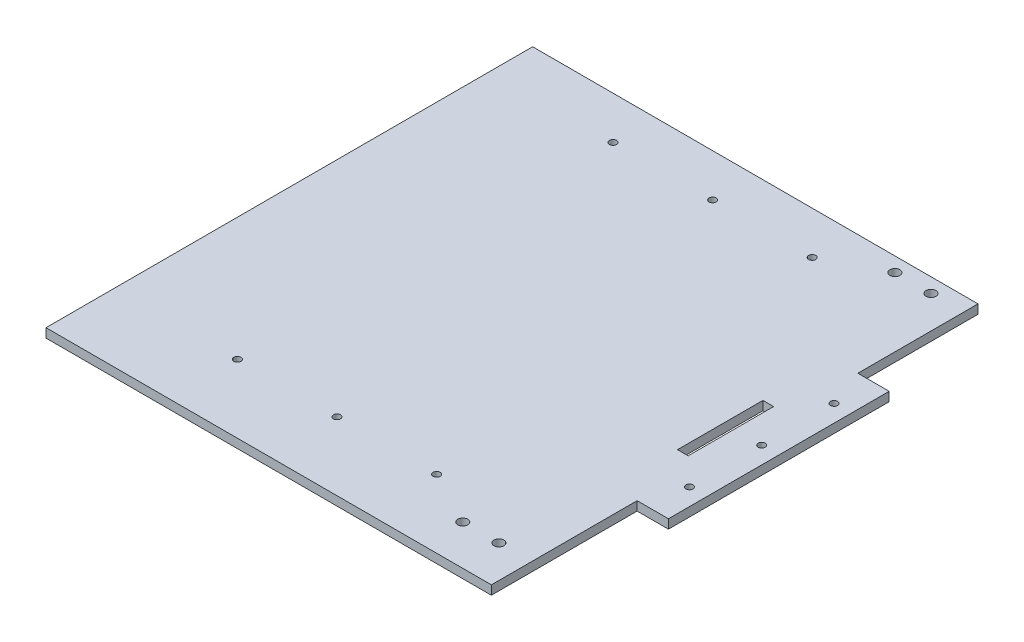
ISO-10303-21;
HEADER;
FILE_DESCRIPTION(('STEP AP214'),'2;1');
FILE_NAME('part.step','',(''),(''),'','','');
FILE_SCHEMA(('AUTOMOTIVE_DESIGN { 1 0 10303 214 1 1 1 1 }'));
ENDSEC;
DATA;
#1=APPLICATION_CONTEXT('core data for automotive mechanical design processes');
#2=APPLICATION_PROTOCOL_DEFINITION('international standard','automotive_design',2000,#1);
#3=PRODUCT_CONTEXT('',#1,'mechanical');
#4=PRODUCT('Part','Part','',(#3));
#5=PRODUCT_RELATED_PRODUCT_CATEGORY('part','',(#4));
#6=PRODUCT_DEFINITION_FORMATION('','',#4);
#7=PRODUCT_DEFINITION_CONTEXT('part definition',#1,'design');
#8=PRODUCT_DEFINITION('design','',#6,#7);
#9=PRODUCT_DEFINITION_SHAPE('','',#8);
#10=(LENGTH_UNIT() NAMED_UNIT(*) SI_UNIT(.MILLI.,.METRE.));
#11=(NAMED_UNIT(*) PLANE_ANGLE_UNIT() SI_UNIT($,.RADIAN.));
#12=(NAMED_UNIT(*) SI_UNIT($,.STERADIAN.) SOLID_ANGLE_UNIT());
#13=UNCERTAINTY_MEASURE_WITH_UNIT(LENGTH_MEASURE(1.E-05),#10,'distance_accuracy_value','');
#14=(GEOMETRIC_REPRESENTATION_CONTEXT(3) GLOBAL_UNCERTAINTY_ASSIGNED_CONTEXT((#13)) GLOBAL_UNIT_ASSIGNED_CONTEXT((#10,
#11,#12)) REPRESENTATION_CONTEXT('',''));
#15=CARTESIAN_POINT('',(0.,0.,0.));
#16=DIRECTION('',(0.,0.,1.));
#17=DIRECTION('',(1.,0.,0.));
#18=AXIS2_PLACEMENT_3D('',#15,#16,#17);
#19=CARTESIAN_POINT('',(156.499999999998,-6.35,171.));
#20=DIRECTION('',(1.,0.,0.));
#21=DIRECTION('',(0.,0.,-1.));
#22=AXIS2_PLACEMENT_3D('',#19,#20,#21);
#23=PLANE('',#22);
#24=DIRECTION('',(0.,0.,-1.));
#25=VECTOR('',#24,1.);
#26=CARTESIAN_POINT('',(156.499999999998,-6.35,171.));
#27=LINE('',#26,#25);
#28=CARTESIAN_POINT('',(156.499999999998,-6.35,171.));
#29=VERTEX_POINT('',#28);
#30=CARTESIAN_POINT('',(156.499999999998,-6.35,68.570201764885));
#31=VERTEX_POINT('',#30);
#32=EDGE_CURVE('E268',#29,#31,#27,.T.);
#33=ORIENTED_EDGE('',*,*,#32,.T.);
#34=DIRECTION('',(0.,1.,0.));
#35=VECTOR('',#34,1.);
#36=CARTESIAN_POINT('',(156.499999999998,-6.35,68.570201764885));
#37=LINE('',#36,#35);
#38=CARTESIAN_POINT('',(156.499999999998,0.,68.570201764885));
#39=VERTEX_POINT('',#38);
#40=EDGE_CURVE('E259',#31,#39,#37,.T.);
#41=ORIENTED_EDGE('',*,*,#40,.T.);
#42=DIRECTION('',(0.,0.,-1.));
#43=VECTOR('',#42,1.);
#44=CARTESIAN_POINT('',(156.499999999998,0.,171.));
#45=LINE('',#44,#43);
#46=CARTESIAN_POINT('',(156.499999999998,0.,171.));
#47=VERTEX_POINT('',#46);
#48=EDGE_CURVE('E281',#47,#39,#45,.T.);
#49=ORIENTED_EDGE('',*,*,#48,.F.);
#50=DIRECTION('',(0.,1.,0.));
#51=VECTOR('',#50,1.);
#52=CARTESIAN_POINT('',(156.499999999998,-6.35,171.));
#53=LINE('',#52,#51);
#54=EDGE_CURVE('E11',#29,#47,#53,.T.);
#55=ORIENTED_EDGE('',*,*,#54,.F.);
#56=EDGE_LOOP('',(#33,#41,#49,#55));
#57=FACE_BOUND('',#56,.T.);
#58=ADVANCED_FACE('F37',(#57),#23,.T.);
#59=DIRECTION('',(0.,1.,0.));
#60=VECTOR('',#59,1.);
#61=CARTESIAN_POINT('',(156.499999999998,-6.35,-86.570201764878));
#62=LINE('',#61,#60);
#63=CARTESIAN_POINT('',(156.499999999998,-6.35,-86.570201764878));
#64=VERTEX_POINT('',#63);
#65=CARTESIAN_POINT('',(156.499999999998,0.,-86.570201764878));
#66=VERTEX_POINT('',#65);
#67=EDGE_CURVE('E263',#64,#66,#62,.T.);
#68=ORIENTED_EDGE('',*,*,#67,.F.);
#69=CARTESIAN_POINT('',(156.499999999998,-6.35,-171.));
#70=VERTEX_POINT('',#69);
#71=EDGE_CURVE('E272',#64,#70,#27,.T.);
#72=ORIENTED_EDGE('',*,*,#71,.T.);
#73=DIRECTION('',(0.,1.,0.));
#74=VECTOR('',#73,1.);
#75=CARTESIAN_POINT('',(156.499999999998,-6.35,-171.));
#76=LINE('',#75,#74);
#77=CARTESIAN_POINT('',(156.499999999998,0.,-171.));
#78=VERTEX_POINT('',#77);
#79=EDGE_CURVE('E41',#70,#78,#76,.T.);
#80=ORIENTED_EDGE('',*,*,#79,.T.);
#81=EDGE_CURVE('E262',#66,#78,#45,.T.);
#82=ORIENTED_EDGE('',*,*,#81,.F.);
#83=EDGE_LOOP('',(#68,#72,#80,#82));
#84=FACE_BOUND('',#83,.T.);
#85=ADVANCED_FACE('F39',(#84),#23,.T.);
#86=CARTESIAN_POINT('',(-156.500000000002,-6.35,171.));
#87=DIRECTION('',(0.,0.,1.));
#88=DIRECTION('',(1.,0.,0.));
#89=AXIS2_PLACEMENT_3D('',#86,#87,#88);
#90=PLANE('',#89);
#91=DIRECTION('',(1.,0.,0.));
#92=VECTOR('',#91,1.);
#93=CARTESIAN_POINT('',(-156.500000000002,0.,171.));
#94=LINE('',#93,#92);
#95=CARTESIAN_POINT('',(-156.500000000002,0.,171.));
#96=VERTEX_POINT('',#95);
#97=EDGE_CURVE('E290',#96,#47,#94,.T.);
#98=ORIENTED_EDGE('',*,*,#97,.F.);
#99=DIRECTION('',(0.,1.,0.));
#100=VECTOR('',#99,1.);
#101=CARTESIAN_POINT('',(-156.500000000002,-6.35,171.));
#102=LINE('',#101,#100);
#103=CARTESIAN_POINT('',(-156.500000000002,-6.35,171.));
#104=VERTEX_POINT('',#103);
#105=EDGE_CURVE('E46',#104,#96,#102,.T.);
#106=ORIENTED_EDGE('',*,*,#105,.F.);
#107=DIRECTION('',(1.,0.,0.));
#108=VECTOR('',#107,1.);
#109=CARTESIAN_POINT('',(-156.500000000002,-6.35,171.));
#110=LINE('',#109,#108);
#111=EDGE_CURVE('E278',#104,#29,#110,.T.);
#112=ORIENTED_EDGE('',*,*,#111,.T.);
#113=ORIENTED_EDGE('',*,*,#54,.T.);
#114=EDGE_LOOP('',(#98,#106,#112,#113));
#115=FACE_BOUND('',#114,.T.);
#116=ADVANCED_FACE('F323',(#115),#90,.T.);
#117=CARTESIAN_POINT('',(-156.500000000002,-6.35,171.));
#118=DIRECTION('',(-1.,0.,0.));
#119=DIRECTION('',(0.,0.,1.));
#120=AXIS2_PLACEMENT_3D('',#117,#118,#119);
#121=PLANE('',#120);
#122=DIRECTION('',(0.,0.,1.));
#123=VECTOR('',#122,1.);
#124=CARTESIAN_POINT('',(-156.500000000002,0.,171.));
#125=LINE('',#124,#123);
#126=CARTESIAN_POINT('',(-156.500000000002,0.,-171.));
#127=VERTEX_POINT('',#126);
#128=EDGE_CURVE('E287',#127,#96,#125,.T.);
#129=ORIENTED_EDGE('',*,*,#128,.F.);
#130=DIRECTION('',(0.,1.,0.));
#131=VECTOR('',#130,1.);
#132=CARTESIAN_POINT('',(-156.500000000002,-6.35,-171.));
#133=LINE('',#132,#131);
#134=CARTESIAN_POINT('',(-156.500000000002,-6.35,-171.));
#135=VERTEX_POINT('',#134);
#136=EDGE_CURVE('E293',#135,#127,#133,.T.);
#137=ORIENTED_EDGE('',*,*,#136,.F.);
#138=DIRECTION('',(0.,0.,1.));
#139=VECTOR('',#138,1.);
#140=CARTESIAN_POINT('',(-156.500000000002,-6.35,171.));
#141=LINE('',#140,#139);
#142=EDGE_CURVE('E275',#135,#104,#141,.T.);
#143=ORIENTED_EDGE('',*,*,#142,.T.);
#144=ORIENTED_EDGE('',*,*,#105,.T.);
#145=EDGE_LOOP('',(#129,#137,#143,#144));
#146=FACE_BOUND('',#145,.T.);
#147=ADVANCED_FACE('F321',(#146),#121,.T.);
#148=CARTESIAN_POINT('',(-156.500000000002,-6.35,-171.));
#149=DIRECTION('',(0.,0.,-1.));
#150=DIRECTION('',(-1.,0.,0.));
#151=AXIS2_PLACEMENT_3D('',#148,#149,#150);
#152=PLANE('',#151);
#153=DIRECTION('',(-1.,0.,0.));
#154=VECTOR('',#153,1.);
#155=CARTESIAN_POINT('',(-156.500000000002,0.,-171.));
#156=LINE('',#155,#154);
#157=EDGE_CURVE('E284',#78,#127,#156,.T.);
#158=ORIENTED_EDGE('',*,*,#157,.F.);
#159=ORIENTED_EDGE('',*,*,#79,.F.);
#160=DIRECTION('',(-1.,0.,0.));
#161=VECTOR('',#160,1.);
#162=CARTESIAN_POINT('',(-156.500000000002,-6.35,-171.));
#163=LINE('',#162,#161);
#164=EDGE_CURVE('E271',#70,#135,#163,.T.);
#165=ORIENTED_EDGE('',*,*,#164,.T.);
#166=ORIENTED_EDGE('',*,*,#136,.T.);
#167=EDGE_LOOP('',(#158,#159,#165,#166));
#168=FACE_BOUND('',#167,.T.);
#169=ADVANCED_FACE('F304',(#168),#152,.T.);
#170=CARTESIAN_POINT('',(0.,-6.35,0.));
#171=DIRECTION('',(0.,-1.,0.));
#172=DIRECTION('',(0.,0.,-1.));
#173=AXIS2_PLACEMENT_3D('',#170,#171,#172);
#174=PLANE('',#173);
#175=DIRECTION('',(-0.000470825318969859,0.,0.999999889161753));
#176=VECTOR('',#175,1.);
#177=CARTESIAN_POINT('',(139.643523721175,-6.35000000001192,23.3262165093637));
#178=LINE('',#177,#176);
#179=CARTESIAN_POINT('',(139.671773243444,-6.35000000001192,-36.6737834906363));
#180=VERTEX_POINT('',#179);
#181=CARTESIAN_POINT('',(139.643523721175,-6.35000000001192,23.3262165093637));
#182=VERTEX_POINT('',#181);
#183=EDGE_CURVE('E129',#180,#182,#178,.T.);
#184=ORIENTED_EDGE('',*,*,#183,.T.);
#185=DIRECTION('',(1.,0.,0.));
#186=VECTOR('',#185,1.);
#187=CARTESIAN_POINT('',(147.143523721174,-6.35000000001192,23.3262165093637));
#188=LINE('',#187,#186);
#189=CARTESIAN_POINT('',(147.143523721174,-6.35,23.3262165093637));
#190=VERTEX_POINT('',#189);
#191=EDGE_CURVE('E138',#182,#190,#188,.T.);
#192=ORIENTED_EDGE('',*,*,#191,.T.);
#193=DIRECTION('',(0.00047082531897171,0.,-0.999999889161753));
#194=VECTOR('',#193,1.);
#195=CARTESIAN_POINT('',(147.171773243444,-6.35000000001192,-36.6737834906363));
#196=LINE('',#195,#194);
#197=CARTESIAN_POINT('',(147.171773243444,-6.35000000001192,-36.6737834906363));
#198=VERTEX_POINT('',#197);
#199=EDGE_CURVE('E54',#190,#198,#196,.T.);
#200=ORIENTED_EDGE('',*,*,#199,.T.);
#201=DIRECTION('',(-1.,0.,0.));
#202=VECTOR('',#201,1.);
#203=CARTESIAN_POINT('',(139.671773243444,-6.35000000001192,-36.6737834906363));
#204=LINE('',#203,#202);
#205=EDGE_CURVE('E135',#198,#180,#204,.T.);
#206=ORIENTED_EDGE('',*,*,#205,.T.);
#207=EDGE_LOOP('',(#184,#192,#200,#206));
#208=FACE_BOUND('',#207,.T.);
#209=CARTESIAN_POINT('',(133.639999999997,-6.35000000001205,142.840000000007));
#210=DIRECTION('',(0.,-1.,0.));
#211=DIRECTION('',(0.,0.,-1.));
#212=AXIS2_PLACEMENT_3D('',#209,#210,#211);
#213=CIRCLE('',#212,3.49999999999999);
#214=CARTESIAN_POINT('',(133.639999999997,-6.35000000001192,139.340000000007));
#215=VERTEX_POINT('',#214);
#216=EDGE_CURVE('E164',#215,#215,#213,.T.);
#217=ORIENTED_EDGE('',*,*,#216,.F.);
#218=EDGE_LOOP('',(#217));
#219=FACE_BOUND('',#218,.T.);
#220=CARTESIAN_POINT('',(108.239999999997,-6.35000000001205,142.840000000007));
#221=DIRECTION('',(0.,-1.,0.));
#222=DIRECTION('',(0.,0.,-1.));
#223=AXIS2_PLACEMENT_3D('',#220,#221,#222);
#224=CIRCLE('',#223,3.50000000000001);
#225=CARTESIAN_POINT('',(108.239999999997,-6.35000000001192,139.340000000007));
#226=VERTEX_POINT('',#225);
#227=EDGE_CURVE('E171',#226,#226,#224,.T.);
#228=ORIENTED_EDGE('',*,*,#227,.F.);
#229=EDGE_LOOP('',(#228));
#230=FACE_BOUND('',#229,.T.);
#231=CARTESIAN_POINT('',(133.639999999998,-6.35,-160.84));
#232=DIRECTION('',(0.,1.,0.));
#233=DIRECTION('',(0.,0.,1.));
#234=AXIS2_PLACEMENT_3D('',#231,#232,#233);
#235=CIRCLE('',#234,3.49999999999999);
#236=CARTESIAN_POINT('',(133.639999999998,-6.35,-157.34));
#237=VERTEX_POINT('',#236);
#238=EDGE_CURVE('E176',#237,#237,#235,.T.);
#239=ORIENTED_EDGE('',*,*,#238,.T.);
#240=EDGE_LOOP('',(#239));
#241=FACE_BOUND('',#240,.T.);
#242=CARTESIAN_POINT('',(108.239999999998,-6.35,-160.84));
#243=DIRECTION('',(0.,1.,0.));
#244=DIRECTION('',(0.,0.,1.));
#245=AXIS2_PLACEMENT_3D('',#242,#243,#244);
#246=CIRCLE('',#245,3.50000000000001);
#247=CARTESIAN_POINT('',(108.239999999998,-6.35,-157.34));
#248=VERTEX_POINT('',#247);
#249=EDGE_CURVE('E167',#248,#248,#246,.T.);
#250=ORIENTED_EDGE('',*,*,#249,.T.);
#251=EDGE_LOOP('',(#250));
#252=FACE_BOUND('',#251,.T.);
#253=CARTESIAN_POINT('',(-70.0000000000018,-6.35,123.000000000004));
#254=DIRECTION('',(0.,1.,0.));
#255=DIRECTION('',(0.,0.,1.));
#256=AXIS2_PLACEMENT_3D('',#253,#254,#255);
#257=CIRCLE('',#256,2.5);
#258=CARTESIAN_POINT('',(-70.0000000000018,-6.35,125.500000000004));
#259=VERTEX_POINT('',#258);
#260=EDGE_CURVE('E198',#259,#259,#257,.T.);
#261=ORIENTED_EDGE('',*,*,#260,.T.);
#262=EDGE_LOOP('',(#261));
#263=FACE_BOUND('',#262,.T.);
#264=CARTESIAN_POINT('',(69.9999999999982,-6.35,123.000000000004));
#265=DIRECTION('',(0.,1.,0.));
#266=DIRECTION('',(0.,0.,-1.));
#267=AXIS2_PLACEMENT_3D('',#264,#265,#266);
#268=CIRCLE('',#267,2.5);
#269=CARTESIAN_POINT('',(69.9999999999982,-6.35,120.500000000004));
#270=VERTEX_POINT('',#269);
#271=EDGE_CURVE('E204',#270,#270,#268,.T.);
#272=ORIENTED_EDGE('',*,*,#271,.T.);
#273=EDGE_LOOP('',(#272));
#274=FACE_BOUND('',#273,.T.);
#275=CARTESIAN_POINT('',(-70.0000000000018,-6.35,-140.999999999997));
#276=DIRECTION('',(0.,1.,0.));
#277=DIRECTION('',(0.,0.,-1.));
#278=AXIS2_PLACEMENT_3D('',#275,#276,#277);
#279=CIRCLE('',#278,2.5);
#280=CARTESIAN_POINT('',(-70.0000000000018,-6.35,-143.499999999997));
#281=VERTEX_POINT('',#280);
#282=EDGE_CURVE('E210',#281,#281,#279,.T.);
#283=ORIENTED_EDGE('',*,*,#282,.T.);
#284=EDGE_LOOP('',(#283));
#285=FACE_BOUND('',#284,.T.);
#286=CARTESIAN_POINT('',(-1.77635683940025E-12,-6.35,-140.999999999996));
#287=DIRECTION('',(0.,1.,0.));
#288=DIRECTION('',(0.,0.,-1.));
#289=AXIS2_PLACEMENT_3D('',#286,#287,#288);
#290=CIRCLE('',#289,2.49999999999998);
#291=CARTESIAN_POINT('',(-1.77635683940025E-12,-6.35,-143.499999999996));
#292=VERTEX_POINT('',#291);
#293=EDGE_CURVE('E191',#292,#292,#290,.T.);
#294=ORIENTED_EDGE('',*,*,#293,.T.);
#295=EDGE_LOOP('',(#294));
#296=FACE_BOUND('',#295,.T.);
#297=CARTESIAN_POINT('',(69.9999999999982,-6.35,-140.999999999997));
#298=DIRECTION('',(0.,1.,0.));
#299=DIRECTION('',(0.,0.,1.));
#300=AXIS2_PLACEMENT_3D('',#297,#298,#299);
#301=CIRCLE('',#300,2.5);
#302=CARTESIAN_POINT('',(69.9999999999982,-6.35,-138.499999999997));
#303=VERTEX_POINT('',#302);
#304=EDGE_CURVE('E179',#303,#303,#301,.T.);
#305=ORIENTED_EDGE('',*,*,#304,.T.);
#306=EDGE_LOOP('',(#305));
#307=FACE_BOUND('',#306,.T.);
#308=CARTESIAN_POINT('',(-1.77635683940025E-12,-6.35,123.000000000004));
#309=DIRECTION('',(0.,1.,0.));
#310=DIRECTION('',(0.,0.,1.));
#311=AXIS2_PLACEMENT_3D('',#308,#309,#310);
#312=CIRCLE('',#311,2.5);
#313=CARTESIAN_POINT('',(-1.77635683940025E-12,-6.35,125.500000000004));
#314=VERTEX_POINT('',#313);
#315=EDGE_CURVE('E218',#314,#314,#312,.T.);
#316=ORIENTED_EDGE('',*,*,#315,.T.);
#317=EDGE_LOOP('',(#316));
#318=FACE_BOUND('',#317,.T.);
#319=ORIENTED_EDGE('',*,*,#32,.F.);
#320=ORIENTED_EDGE('',*,*,#111,.F.);
#321=ORIENTED_EDGE('',*,*,#142,.F.);
#322=ORIENTED_EDGE('',*,*,#164,.F.);
#323=ORIENTED_EDGE('',*,*,#71,.F.);
#324=DIRECTION('',(-1.,0.,0.));
#325=VECTOR('',#324,1.);
#326=CARTESIAN_POINT('',(178.499999999998,-6.35,-86.570201764878));
#327=LINE('',#326,#325);
#328=CARTESIAN_POINT('',(178.499999999998,-6.35,-86.570201764878));
#329=VERTEX_POINT('',#328);
#330=EDGE_CURVE('E249',#329,#64,#327,.T.);
#331=ORIENTED_EDGE('',*,*,#330,.F.);
#332=DIRECTION('',(0.,0.,-1.));
#333=VECTOR('',#332,1.);
#334=CARTESIAN_POINT('',(178.499999999998,-6.35,68.570201764885));
#335=LINE('',#334,#333);
#336=CARTESIAN_POINT('',(178.499999999998,-6.35,68.570201764885));
#337=VERTEX_POINT('',#336);
#338=EDGE_CURVE('E245',#337,#329,#335,.T.);
#339=ORIENTED_EDGE('',*,*,#338,.F.);
#340=DIRECTION('',(1.,0.,0.));
#341=VECTOR('',#340,1.);
#342=CARTESIAN_POINT('',(156.499999999998,-6.35,68.570201764885));
#343=LINE('',#342,#341);
#344=EDGE_CURVE('E242',#31,#337,#343,.T.);
#345=ORIENTED_EDGE('',*,*,#344,.F.);
#346=EDGE_LOOP('',(#319,#320,#321,#322,#323,#331,#339,#345));
#347=FACE_BOUND('',#346,.T.);
#348=CARTESIAN_POINT('',(166.499999999998,-6.35,-59.7999999999965));
#349=DIRECTION('',(0.,1.,0.));
#350=DIRECTION('',(0.,0.,-1.));
#351=AXIS2_PLACEMENT_3D('',#348,#349,#350);
#352=CIRCLE('',#351,2.5);
#353=CARTESIAN_POINT('',(166.499999999998,-6.35,-62.2999999999965));
#354=VERTEX_POINT('',#353);
#355=EDGE_CURVE('E224',#354,#354,#352,.T.);
#356=ORIENTED_EDGE('',*,*,#355,.T.);
#357=EDGE_LOOP('',(#356));
#358=FACE_BOUND('',#357,.T.);
#359=CARTESIAN_POINT('',(166.499999999998,-6.35,41.8000000000035));
#360=DIRECTION('',(0.,1.,0.));
#361=DIRECTION('',(0.,0.,1.));
#362=AXIS2_PLACEMENT_3D('',#359,#360,#361);
#363=CIRCLE('',#362,2.5);
#364=CARTESIAN_POINT('',(166.499999999998,-6.35,44.3000000000035));
#365=VERTEX_POINT('',#364);
#366=EDGE_CURVE('E230',#365,#365,#363,.T.);
#367=ORIENTED_EDGE('',*,*,#366,.T.);
#368=EDGE_LOOP('',(#367));
#369=FACE_BOUND('',#368,.T.);
#370=CARTESIAN_POINT('',(166.499999999998,-6.35,-8.99999999999648));
#371=DIRECTION('',(0.,1.,0.));
#372=DIRECTION('',(0.,0.,1.));
#373=AXIS2_PLACEMENT_3D('',#370,#371,#372);
#374=CIRCLE('',#373,2.5);
#375=CARTESIAN_POINT('',(166.499999999998,-6.35,-6.49999999999649));
#376=VERTEX_POINT('',#375);
#377=EDGE_CURVE('E236',#376,#376,#374,.T.);
#378=ORIENTED_EDGE('',*,*,#377,.T.);
#379=EDGE_LOOP('',(#378));
#380=FACE_BOUND('',#379,.T.);
#381=ADVANCED_FACE('F142',(#208,#219,#230,#241,#252,#263,#274,#285,#296,#307,#318,#347,#358,
#369,#380),#174,.T.);
#382=CARTESIAN_POINT('',(0.,0.,0.));
#383=DIRECTION('',(0.,-1.,0.));
#384=DIRECTION('',(0.,0.,-1.));
#385=AXIS2_PLACEMENT_3D('',#382,#383,#384);
#386=PLANE('',#385);
#387=DIRECTION('',(1.,0.,0.));
#388=VECTOR('',#387,1.);
#389=CARTESIAN_POINT('',(147.143523721174,0.,23.3262165093637));
#390=LINE('',#389,#388);
#391=CARTESIAN_POINT('',(139.643523721175,0.,23.3262165093637));
#392=VERTEX_POINT('',#391);
#393=CARTESIAN_POINT('',(147.143523721174,0.,23.3262165093637));
#394=VERTEX_POINT('',#393);
#395=EDGE_CURVE('E154',#392,#394,#390,.T.);
#396=ORIENTED_EDGE('',*,*,#395,.F.);
#397=DIRECTION('',(-0.000470825318969859,0.,0.999999889161753));
#398=VECTOR('',#397,1.);
#399=CARTESIAN_POINT('',(139.643523721175,0.,23.3262165093637));
#400=LINE('',#399,#398);
#401=CARTESIAN_POINT('',(139.671773243444,0.,-36.6737834906363));
#402=VERTEX_POINT('',#401);
#403=EDGE_CURVE('E62',#402,#392,#400,.T.);
#404=ORIENTED_EDGE('',*,*,#403,.F.);
#405=DIRECTION('',(-1.,0.,0.));
#406=VECTOR('',#405,1.);
#407=CARTESIAN_POINT('',(139.671773243444,0.,-36.6737834906363));
#408=LINE('',#407,#406);
#409=CARTESIAN_POINT('',(147.171773243444,0.,-36.6737834906363));
#410=VERTEX_POINT('',#409);
#411=EDGE_CURVE('E145',#410,#402,#408,.T.);
#412=ORIENTED_EDGE('',*,*,#411,.F.);
#413=DIRECTION('',(0.00047082531897171,0.,-0.999999889161753));
#414=VECTOR('',#413,1.);
#415=CARTESIAN_POINT('',(147.171773243444,0.,-36.6737834906363));
#416=LINE('',#415,#414);
#417=EDGE_CURVE('E148',#394,#410,#416,.T.);
#418=ORIENTED_EDGE('',*,*,#417,.F.);
#419=EDGE_LOOP('',(#396,#404,#412,#418));
#420=FACE_BOUND('',#419,.T.);
#421=CARTESIAN_POINT('',(133.639999999997,-5.83162409271469E-12,142.840000000007));
#422=DIRECTION('',(0.,-1.,0.));
#423=DIRECTION('',(0.,0.,-1.));
#424=AXIS2_PLACEMENT_3D('',#421,#422,#423);
#425=CIRCLE('',#424,3.49999999999999);
#426=CARTESIAN_POINT('',(133.639999999997,-5.69720177761655E-12,139.340000000007));
#427=VERTEX_POINT('',#426);
#428=EDGE_CURVE('E168',#427,#427,#425,.T.);
#429=ORIENTED_EDGE('',*,*,#428,.T.);
#430=EDGE_LOOP('',(#429));
#431=FACE_BOUND('',#430,.T.);
#432=CARTESIAN_POINT('',(108.239999999997,-5.83162409271469E-12,142.840000000007));
#433=DIRECTION('',(0.,-1.,0.));
#434=DIRECTION('',(0.,0.,-1.));
#435=AXIS2_PLACEMENT_3D('',#432,#433,#434);
#436=CIRCLE('',#435,3.50000000000001);
#437=CARTESIAN_POINT('',(108.239999999997,-5.69720177761655E-12,139.340000000007));
#438=VERTEX_POINT('',#437);
#439=EDGE_CURVE('E160',#438,#438,#436,.T.);
#440=ORIENTED_EDGE('',*,*,#439,.T.);
#441=EDGE_LOOP('',(#440));
#442=FACE_BOUND('',#441,.T.);
#443=CARTESIAN_POINT('',(133.639999999998,0.,-160.84));
#444=DIRECTION('',(0.,1.,0.));
#445=DIRECTION('',(0.,0.,1.));
#446=AXIS2_PLACEMENT_3D('',#443,#444,#445);
#447=CIRCLE('',#446,3.49999999999999);
#448=CARTESIAN_POINT('',(133.639999999998,0.,-157.34));
#449=VERTEX_POINT('',#448);
#450=EDGE_CURVE('E180',#449,#449,#447,.T.);
#451=ORIENTED_EDGE('',*,*,#450,.F.);
#452=EDGE_LOOP('',(#451));
#453=FACE_BOUND('',#452,.T.);
#454=CARTESIAN_POINT('',(108.239999999998,0.,-160.84));
#455=DIRECTION('',(0.,1.,0.));
#456=DIRECTION('',(0.,0.,1.));
#457=AXIS2_PLACEMENT_3D('',#454,#455,#456);
#458=CIRCLE('',#457,3.50000000000001);
#459=CARTESIAN_POINT('',(108.239999999998,0.,-157.34));
#460=VERTEX_POINT('',#459);
#461=EDGE_CURVE('E183',#460,#460,#458,.T.);
#462=ORIENTED_EDGE('',*,*,#461,.F.);
#463=EDGE_LOOP('',(#462));
#464=FACE_BOUND('',#463,.T.);
#465=CARTESIAN_POINT('',(-70.0000000000018,0.,123.000000000004));
#466=DIRECTION('',(0.,1.,0.));
#467=DIRECTION('',(0.,0.,1.));
#468=AXIS2_PLACEMENT_3D('',#465,#466,#467);
#469=CIRCLE('',#468,2.5);
#470=CARTESIAN_POINT('',(-70.0000000000018,0.,125.500000000004));
#471=VERTEX_POINT('',#470);
#472=EDGE_CURVE('E194',#471,#471,#469,.T.);
#473=ORIENTED_EDGE('',*,*,#472,.F.);
#474=EDGE_LOOP('',(#473));
#475=FACE_BOUND('',#474,.T.);
#476=CARTESIAN_POINT('',(69.9999999999982,0.,123.000000000004));
#477=DIRECTION('',(0.,1.,0.));
#478=DIRECTION('',(0.,0.,-1.));
#479=AXIS2_PLACEMENT_3D('',#476,#477,#478);
#480=CIRCLE('',#479,2.5);
#481=CARTESIAN_POINT('',(69.9999999999982,0.,120.500000000004));
#482=VERTEX_POINT('',#481);
#483=EDGE_CURVE('E201',#482,#482,#480,.T.);
#484=ORIENTED_EDGE('',*,*,#483,.F.);
#485=EDGE_LOOP('',(#484));
#486=FACE_BOUND('',#485,.T.);
#487=CARTESIAN_POINT('',(-70.0000000000018,0.,-140.999999999997));
#488=DIRECTION('',(0.,1.,0.));
#489=DIRECTION('',(0.,0.,-1.));
#490=AXIS2_PLACEMENT_3D('',#487,#488,#489);
#491=CIRCLE('',#490,2.5);
#492=CARTESIAN_POINT('',(-70.0000000000018,0.,-143.499999999997));
#493=VERTEX_POINT('',#492);
#494=EDGE_CURVE('E207',#493,#493,#491,.T.);
#495=ORIENTED_EDGE('',*,*,#494,.F.);
#496=EDGE_LOOP('',(#495));
#497=FACE_BOUND('',#496,.T.);
#498=CARTESIAN_POINT('',(-1.77635683940025E-12,0.,-140.999999999996));
#499=DIRECTION('',(0.,1.,0.));
#500=DIRECTION('',(0.,0.,-1.));
#501=AXIS2_PLACEMENT_3D('',#498,#499,#500);
#502=CIRCLE('',#501,2.49999999999998);
#503=CARTESIAN_POINT('',(-1.77635683940025E-12,0.,-143.499999999996));
#504=VERTEX_POINT('',#503);
#505=EDGE_CURVE('E213',#504,#504,#502,.T.);
#506=ORIENTED_EDGE('',*,*,#505,.F.);
#507=EDGE_LOOP('',(#506));
#508=FACE_BOUND('',#507,.T.);
#509=CARTESIAN_POINT('',(69.9999999999982,0.,-140.999999999997));
#510=DIRECTION('',(0.,1.,0.));
#511=DIRECTION('',(0.,0.,1.));
#512=AXIS2_PLACEMENT_3D('',#509,#510,#511);
#513=CIRCLE('',#512,2.5);
#514=CARTESIAN_POINT('',(69.9999999999982,0.,-138.499999999997));
#515=VERTEX_POINT('',#514);
#516=EDGE_CURVE('E188',#515,#515,#513,.T.);
#517=ORIENTED_EDGE('',*,*,#516,.F.);
#518=EDGE_LOOP('',(#517));
#519=FACE_BOUND('',#518,.T.);
#520=CARTESIAN_POINT('',(-1.77635683940025E-12,0.,123.000000000004));
#521=DIRECTION('',(0.,1.,0.));
#522=DIRECTION('',(0.,0.,1.));
#523=AXIS2_PLACEMENT_3D('',#520,#521,#522);
#524=CIRCLE('',#523,2.5);
#525=CARTESIAN_POINT('',(-1.77635683940025E-12,0.,125.500000000004));
#526=VERTEX_POINT('',#525);
#527=EDGE_CURVE('E197',#526,#526,#524,.T.);
#528=ORIENTED_EDGE('',*,*,#527,.F.);
#529=EDGE_LOOP('',(#528));
#530=FACE_BOUND('',#529,.T.);
#531=ORIENTED_EDGE('',*,*,#48,.T.);
#532=DIRECTION('',(1.,0.,0.));
#533=VECTOR('',#532,1.);
#534=CARTESIAN_POINT('',(156.499999999998,0.,68.570201764885));
#535=LINE('',#534,#533);
#536=CARTESIAN_POINT('',(178.499999999998,0.,68.570201764885));
#537=VERTEX_POINT('',#536);
#538=EDGE_CURVE('E239',#39,#537,#535,.T.);
#539=ORIENTED_EDGE('',*,*,#538,.T.);
#540=DIRECTION('',(0.,0.,-1.));
#541=VECTOR('',#540,1.);
#542=CARTESIAN_POINT('',(178.499999999998,0.,68.570201764885));
#543=LINE('',#542,#541);
#544=CARTESIAN_POINT('',(178.499999999998,0.,-86.570201764878));
#545=VERTEX_POINT('',#544);
#546=EDGE_CURVE('E254',#537,#545,#543,.T.);
#547=ORIENTED_EDGE('',*,*,#546,.T.);
#548=DIRECTION('',(-1.,0.,0.));
#549=VECTOR('',#548,1.);
#550=CARTESIAN_POINT('',(178.499999999998,0.,-86.570201764878));
#551=LINE('',#550,#549);
#552=EDGE_CURVE('E246',#545,#66,#551,.T.);
#553=ORIENTED_EDGE('',*,*,#552,.T.);
#554=ORIENTED_EDGE('',*,*,#81,.T.);
#555=ORIENTED_EDGE('',*,*,#157,.T.);
#556=ORIENTED_EDGE('',*,*,#128,.T.);
#557=ORIENTED_EDGE('',*,*,#97,.T.);
#558=EDGE_LOOP('',(#531,#539,#547,#553,#554,#555,#556,#557));
#559=FACE_BOUND('',#558,.T.);
#560=CARTESIAN_POINT('',(166.499999999998,0.,-59.7999999999965));
#561=DIRECTION('',(0.,1.,0.));
#562=DIRECTION('',(0.,0.,-1.));
#563=AXIS2_PLACEMENT_3D('',#560,#561,#562);
#564=CIRCLE('',#563,2.5);
#565=CARTESIAN_POINT('',(166.499999999998,0.,-62.2999999999965));
#566=VERTEX_POINT('',#565);
#567=EDGE_CURVE('E221',#566,#566,#564,.T.);
#568=ORIENTED_EDGE('',*,*,#567,.F.);
#569=EDGE_LOOP('',(#568));
#570=FACE_BOUND('',#569,.T.);
#571=CARTESIAN_POINT('',(166.499999999998,0.,41.8000000000035));
#572=DIRECTION('',(0.,1.,0.));
#573=DIRECTION('',(0.,0.,1.));
#574=AXIS2_PLACEMENT_3D('',#571,#572,#573);
#575=CIRCLE('',#574,2.5);
#576=CARTESIAN_POINT('',(166.499999999998,0.,44.3000000000035));
#577=VERTEX_POINT('',#576);
#578=EDGE_CURVE('E227',#577,#577,#575,.T.);
#579=ORIENTED_EDGE('',*,*,#578,.F.);
#580=EDGE_LOOP('',(#579));
#581=FACE_BOUND('',#580,.T.);
#582=CARTESIAN_POINT('',(166.499999999998,0.,-8.99999999999648));
#583=DIRECTION('',(0.,1.,0.));
#584=DIRECTION('',(0.,0.,1.));
#585=AXIS2_PLACEMENT_3D('',#582,#583,#584);
#586=CIRCLE('',#585,2.5);
#587=CARTESIAN_POINT('',(166.499999999998,0.,-6.49999999999649));
#588=VERTEX_POINT('',#587);
#589=EDGE_CURVE('E233',#588,#588,#586,.T.);
#590=ORIENTED_EDGE('',*,*,#589,.F.);
#591=EDGE_LOOP('',(#590));
#592=FACE_BOUND('',#591,.T.);
#593=ADVANCED_FACE('F306',(#420,#431,#442,#453,#464,#475,#486,#497,#508,#519,#530,#559,#570,
#581,#592),#386,.F.);
#594=CARTESIAN_POINT('',(156.499999999998,-6.35,68.570201764885));
#595=DIRECTION('',(0.,0.,1.));
#596=DIRECTION('',(1.,0.,0.));
#597=AXIS2_PLACEMENT_3D('',#594,#595,#596);
#598=PLANE('',#597);
#599=ORIENTED_EDGE('',*,*,#538,.F.);
#600=ORIENTED_EDGE('',*,*,#40,.F.);
#601=ORIENTED_EDGE('',*,*,#344,.T.);
#602=DIRECTION('',(0.,1.,0.));
#603=VECTOR('',#602,1.);
#604=CARTESIAN_POINT('',(178.499999999998,-6.35,68.570201764885));
#605=LINE('',#604,#603);
#606=EDGE_CURVE('E251',#337,#537,#605,.T.);
#607=ORIENTED_EDGE('',*,*,#606,.T.);
#608=EDGE_LOOP('',(#599,#600,#601,#607));
#609=FACE_BOUND('',#608,.T.);
#610=ADVANCED_FACE('F328',(#609),#598,.T.);
#611=CARTESIAN_POINT('',(178.499999999998,-6.35,-86.570201764878));
#612=DIRECTION('',(0.,0.,-1.));
#613=DIRECTION('',(-1.,0.,0.));
#614=AXIS2_PLACEMENT_3D('',#611,#612,#613);
#615=PLANE('',#614);
#616=ORIENTED_EDGE('',*,*,#552,.F.);
#617=DIRECTION('',(0.,1.,0.));
#618=VECTOR('',#617,1.);
#619=CARTESIAN_POINT('',(178.499999999998,-6.35,-86.570201764878));
#620=LINE('',#619,#618);
#621=EDGE_CURVE('E265',#329,#545,#620,.T.);
#622=ORIENTED_EDGE('',*,*,#621,.F.);
#623=ORIENTED_EDGE('',*,*,#330,.T.);
#624=ORIENTED_EDGE('',*,*,#67,.T.);
#625=EDGE_LOOP('',(#616,#622,#623,#624));
#626=FACE_BOUND('',#625,.T.);
#627=ADVANCED_FACE('F312',(#626),#615,.T.);
#628=CARTESIAN_POINT('',(178.499999999998,-6.35,68.570201764885));
#629=DIRECTION('',(1.,0.,0.));
#630=DIRECTION('',(0.,0.,-1.));
#631=AXIS2_PLACEMENT_3D('',#628,#629,#630);
#632=PLANE('',#631);
#633=ORIENTED_EDGE('',*,*,#546,.F.);
#634=ORIENTED_EDGE('',*,*,#606,.F.);
#635=ORIENTED_EDGE('',*,*,#338,.T.);
#636=ORIENTED_EDGE('',*,*,#621,.T.);
#637=EDGE_LOOP('',(#633,#634,#635,#636));
#638=FACE_BOUND('',#637,.T.);
#639=ADVANCED_FACE('F330',(#638),#632,.T.);
#640=CARTESIAN_POINT('',(166.499999999998,-6.35,-8.99999999999648));
#641=DIRECTION('',(0.,1.,0.));
#642=DIRECTION('',(0.,0.,1.));
#643=AXIS2_PLACEMENT_3D('',#640,#641,#642);
#644=CYLINDRICAL_SURFACE('',#643,2.5);
#645=ORIENTED_EDGE('',*,*,#377,.F.);
#646=EDGE_LOOP('',(#645));
#647=FACE_BOUND('',#646,.T.);
#648=ORIENTED_EDGE('',*,*,#589,.T.);
#649=EDGE_LOOP('',(#648));
#650=FACE_BOUND('',#649,.T.);
#651=ADVANCED_FACE('F332',(#647,#650),#644,.F.);
#652=CARTESIAN_POINT('',(166.499999999998,-6.35,41.8000000000035));
#653=DIRECTION('',(0.,1.,0.));
#654=DIRECTION('',(0.,0.,1.));
#655=AXIS2_PLACEMENT_3D('',#652,#653,#654);
#656=CYLINDRICAL_SURFACE('',#655,2.5);
#657=ORIENTED_EDGE('',*,*,#366,.F.);
#658=EDGE_LOOP('',(#657));
#659=FACE_BOUND('',#658,.T.);
#660=ORIENTED_EDGE('',*,*,#578,.T.);
#661=EDGE_LOOP('',(#660));
#662=FACE_BOUND('',#661,.T.);
#663=ADVANCED_FACE('F338',(#659,#662),#656,.F.);
#664=CARTESIAN_POINT('',(166.499999999998,-6.35,-59.7999999999965));
#665=DIRECTION('',(0.,1.,0.));
#666=DIRECTION('',(0.,0.,1.));
#667=AXIS2_PLACEMENT_3D('',#664,#665,#666);
#668=CYLINDRICAL_SURFACE('',#667,2.5);
#669=ORIENTED_EDGE('',*,*,#355,.F.);
#670=EDGE_LOOP('',(#669));
#671=FACE_BOUND('',#670,.T.);
#672=ORIENTED_EDGE('',*,*,#567,.T.);
#673=EDGE_LOOP('',(#672));
#674=FACE_BOUND('',#673,.T.);
#675=ADVANCED_FACE('F396',(#671,#674),#668,.F.);
#676=CARTESIAN_POINT('',(-1.77635683940025E-12,-6.35,123.000000000004));
#677=DIRECTION('',(0.,1.,0.));
#678=DIRECTION('',(0.,0.,1.));
#679=AXIS2_PLACEMENT_3D('',#676,#677,#678);
#680=CYLINDRICAL_SURFACE('',#679,2.5);
#681=ORIENTED_EDGE('',*,*,#315,.F.);
#682=EDGE_LOOP('',(#681));
#683=FACE_BOUND('',#682,.T.);
#684=ORIENTED_EDGE('',*,*,#527,.T.);
#685=EDGE_LOOP('',(#684));
#686=FACE_BOUND('',#685,.T.);
#687=ADVANCED_FACE('F407',(#683,#686),#680,.F.);
#688=CARTESIAN_POINT('',(69.9999999999982,-6.35,-140.999999999997));
#689=DIRECTION('',(0.,1.,0.));
#690=DIRECTION('',(0.,0.,1.));
#691=AXIS2_PLACEMENT_3D('',#688,#689,#690);
#692=CYLINDRICAL_SURFACE('',#691,2.5);
#693=ORIENTED_EDGE('',*,*,#304,.F.);
#694=EDGE_LOOP('',(#693));
#695=FACE_BOUND('',#694,.T.);
#696=ORIENTED_EDGE('',*,*,#516,.T.);
#697=EDGE_LOOP('',(#696));
#698=FACE_BOUND('',#697,.T.);
#699=ADVANCED_FACE('F418',(#695,#698),#692,.F.);
#700=CARTESIAN_POINT('',(-1.77635683940025E-12,-6.35,-140.999999999996));
#701=DIRECTION('',(0.,1.,0.));
#702=DIRECTION('',(0.,0.,1.));
#703=AXIS2_PLACEMENT_3D('',#700,#701,#702);
#704=CYLINDRICAL_SURFACE('',#703,2.49999999999998);
#705=ORIENTED_EDGE('',*,*,#293,.F.);
#706=EDGE_LOOP('',(#705));
#707=FACE_BOUND('',#706,.T.);
#708=ORIENTED_EDGE('',*,*,#505,.T.);
#709=EDGE_LOOP('',(#708));
#710=FACE_BOUND('',#709,.T.);
#711=ADVANCED_FACE('F429',(#707,#710),#704,.F.);
#712=CARTESIAN_POINT('',(-70.0000000000018,-6.35,-140.999999999997));
#713=DIRECTION('',(0.,1.,0.));
#714=DIRECTION('',(0.,0.,1.));
#715=AXIS2_PLACEMENT_3D('',#712,#713,#714);
#716=CYLINDRICAL_SURFACE('',#715,2.5);
#717=ORIENTED_EDGE('',*,*,#282,.F.);
#718=EDGE_LOOP('',(#717));
#719=FACE_BOUND('',#718,.T.);
#720=ORIENTED_EDGE('',*,*,#494,.T.);
#721=EDGE_LOOP('',(#720));
#722=FACE_BOUND('',#721,.T.);
#723=ADVANCED_FACE('F440',(#719,#722),#716,.F.);
#724=CARTESIAN_POINT('',(69.9999999999982,-6.35,123.000000000004));
#725=DIRECTION('',(0.,1.,0.));
#726=DIRECTION('',(0.,0.,1.));
#727=AXIS2_PLACEMENT_3D('',#724,#725,#726);
#728=CYLINDRICAL_SURFACE('',#727,2.5);
#729=ORIENTED_EDGE('',*,*,#271,.F.);
#730=EDGE_LOOP('',(#729));
#731=FACE_BOUND('',#730,.T.);
#732=ORIENTED_EDGE('',*,*,#483,.T.);
#733=EDGE_LOOP('',(#732));
#734=FACE_BOUND('',#733,.T.);
#735=ADVANCED_FACE('F451',(#731,#734),#728,.F.);
#736=CARTESIAN_POINT('',(-70.0000000000018,-6.35,123.000000000004));
#737=DIRECTION('',(0.,1.,0.));
#738=DIRECTION('',(0.,0.,1.));
#739=AXIS2_PLACEMENT_3D('',#736,#737,#738);
#740=CYLINDRICAL_SURFACE('',#739,2.5);
#741=ORIENTED_EDGE('',*,*,#260,.F.);
#742=EDGE_LOOP('',(#741));
#743=FACE_BOUND('',#742,.T.);
#744=ORIENTED_EDGE('',*,*,#472,.T.);
#745=EDGE_LOOP('',(#744));
#746=FACE_BOUND('',#745,.T.);
#747=ADVANCED_FACE('F462',(#743,#746),#740,.F.);
#748=CARTESIAN_POINT('',(108.239999999998,-6.35,-160.84));
#749=DIRECTION('',(0.,1.,0.));
#750=DIRECTION('',(0.,0.,1.));
#751=AXIS2_PLACEMENT_3D('',#748,#749,#750);
#752=CYLINDRICAL_SURFACE('',#751,3.50000000000001);
#753=ORIENTED_EDGE('',*,*,#249,.F.);
#754=EDGE_LOOP('',(#753));
#755=FACE_BOUND('',#754,.T.);
#756=ORIENTED_EDGE('',*,*,#461,.T.);
#757=EDGE_LOOP('',(#756));
#758=FACE_BOUND('',#757,.T.);
#759=ADVANCED_FACE('F473',(#755,#758),#752,.F.);
#760=CARTESIAN_POINT('',(133.639999999998,-6.35,-160.84));
#761=DIRECTION('',(0.,1.,0.));
#762=DIRECTION('',(0.,0.,1.));
#763=AXIS2_PLACEMENT_3D('',#760,#761,#762);
#764=CYLINDRICAL_SURFACE('',#763,3.49999999999999);
#765=ORIENTED_EDGE('',*,*,#238,.F.);
#766=EDGE_LOOP('',(#765));
#767=FACE_BOUND('',#766,.T.);
#768=ORIENTED_EDGE('',*,*,#450,.T.);
#769=EDGE_LOOP('',(#768));
#770=FACE_BOUND('',#769,.T.);
#771=ADVANCED_FACE('F484',(#767,#770),#764,.F.);
#772=CARTESIAN_POINT('',(108.239999999997,-6.35000000001205,142.840000000007));
#773=DIRECTION('',(0.,1.,0.));
#774=DIRECTION('',(0.,0.,1.));
#775=AXIS2_PLACEMENT_3D('',#772,#773,#774);
#776=CYLINDRICAL_SURFACE('',#775,3.50000000000001);
#777=ORIENTED_EDGE('',*,*,#227,.T.);
#778=EDGE_LOOP('',(#777));
#779=FACE_BOUND('',#778,.T.);
#780=ORIENTED_EDGE('',*,*,#439,.F.);
#781=EDGE_LOOP('',(#780));
#782=FACE_BOUND('',#781,.T.);
#783=ADVANCED_FACE('F495',(#779,#782),#776,.F.);
#784=CARTESIAN_POINT('',(133.639999999997,-6.35000000001205,142.840000000007));
#785=DIRECTION('',(0.,1.,0.));
#786=DIRECTION('',(0.,0.,1.));
#787=AXIS2_PLACEMENT_3D('',#784,#785,#786);
#788=CYLINDRICAL_SURFACE('',#787,3.49999999999999);
#789=ORIENTED_EDGE('',*,*,#216,.T.);
#790=EDGE_LOOP('',(#789));
#791=FACE_BOUND('',#790,.T.);
#792=ORIENTED_EDGE('',*,*,#428,.F.);
#793=EDGE_LOOP('',(#792));
#794=FACE_BOUND('',#793,.T.);
#795=ADVANCED_FACE('F506',(#791,#794),#788,.F.);
#796=CARTESIAN_POINT('',(139.643523721175,-6.35000000001192,23.3262165093637));
#797=DIRECTION('',(-0.999999889161753,0.,-0.000470825318969859));
#798=DIRECTION('',(-0.000470825318969859,0.,0.999999889161753));
#799=AXIS2_PLACEMENT_3D('',#796,#797,#798);
#800=PLANE('',#799);
#801=ORIENTED_EDGE('',*,*,#403,.T.);
#802=DIRECTION('',(0.,1.,0.));
#803=VECTOR('',#802,1.);
#804=CARTESIAN_POINT('',(139.643523721175,-6.35000000001192,23.3262165093637));
#805=LINE('',#804,#803);
#806=EDGE_CURVE('E125',#182,#392,#805,.T.);
#807=ORIENTED_EDGE('',*,*,#806,.F.);
#808=ORIENTED_EDGE('',*,*,#183,.F.);
#809=DIRECTION('',(0.,1.,0.));
#810=VECTOR('',#809,1.);
#811=CARTESIAN_POINT('',(139.671773243444,-6.35000000001192,-36.6737834906363));
#812=LINE('',#811,#810);
#813=EDGE_CURVE('E158',#180,#402,#812,.T.);
#814=ORIENTED_EDGE('',*,*,#813,.T.);
#815=EDGE_LOOP('',(#801,#807,#808,#814));
#816=FACE_BOUND('',#815,.T.);
#817=ADVANCED_FACE('F127',(#816),#800,.F.);
#818=CARTESIAN_POINT('',(139.671773243444,-6.35000000001192,-36.6737834906363));
#819=DIRECTION('',(0.,0.,-1.));
#820=DIRECTION('',(-1.,0.,0.));
#821=AXIS2_PLACEMENT_3D('',#818,#819,#820);
#822=PLANE('',#821);
#823=ORIENTED_EDGE('',*,*,#411,.T.);
#824=ORIENTED_EDGE('',*,*,#813,.F.);
#825=ORIENTED_EDGE('',*,*,#205,.F.);
#826=DIRECTION('',(0.,1.,0.));
#827=VECTOR('',#826,1.);
#828=CARTESIAN_POINT('',(147.171773243444,-6.35000000001192,-36.6737834906363));
#829=LINE('',#828,#827);
#830=EDGE_CURVE('E161',#198,#410,#829,.T.);
#831=ORIENTED_EDGE('',*,*,#830,.T.);
#832=EDGE_LOOP('',(#823,#824,#825,#831));
#833=FACE_BOUND('',#832,.T.);
#834=ADVANCED_FACE('F538',(#833),#822,.F.);
#835=CARTESIAN_POINT('',(147.171773243444,-6.35000000001192,-36.6737834906363));
#836=DIRECTION('',(0.999999889161753,0.,0.00047082531897171));
#837=DIRECTION('',(0.00047082531897171,0.,-0.999999889161753));
#838=AXIS2_PLACEMENT_3D('',#835,#836,#837);
#839=PLANE('',#838);
#840=ORIENTED_EDGE('',*,*,#417,.T.);
#841=ORIENTED_EDGE('',*,*,#830,.F.);
#842=ORIENTED_EDGE('',*,*,#199,.F.);
#843=DIRECTION('',(0.,1.,0.));
#844=VECTOR('',#843,1.);
#845=CARTESIAN_POINT('',(147.143523721174,-6.35000000001192,23.3262165093637));
#846=LINE('',#845,#844);
#847=EDGE_CURVE('E134',#190,#394,#846,.T.);
#848=ORIENTED_EDGE('',*,*,#847,.T.);
#849=EDGE_LOOP('',(#840,#841,#842,#848));
#850=FACE_BOUND('',#849,.T.);
#851=ADVANCED_FACE('F548',(#850),#839,.F.);
#852=CARTESIAN_POINT('',(147.143523721174,-6.35000000001192,23.3262165093637));
#853=DIRECTION('',(0.,0.,1.));
#854=DIRECTION('',(1.,0.,0.));
#855=AXIS2_PLACEMENT_3D('',#852,#853,#854);
#856=PLANE('',#855);
#857=ORIENTED_EDGE('',*,*,#395,.T.);
#858=ORIENTED_EDGE('',*,*,#847,.F.);
#859=ORIENTED_EDGE('',*,*,#191,.F.);
#860=ORIENTED_EDGE('',*,*,#806,.T.);
#861=EDGE_LOOP('',(#857,#858,#859,#860));
#862=FACE_BOUND('',#861,.T.);
#863=ADVANCED_FACE('F139',(#862),#856,.F.);
#864=CLOSED_SHELL('',(#58,#85,#116,#147,#169,#381,#593,#610,#627,#639,#651,#663,#675,#687,#699,
#711,#723,#735,#747,#759,#771,#783,#795,#817,#834,#851,#863));
#865=MANIFOLD_SOLID_BREP('B2',#864);
#866=ADVANCED_BREP_SHAPE_REPRESENTATION('',(#18,#865),#14);
#867=SHAPE_DEFINITION_REPRESENTATION(#9,#866);
ENDSEC;
END-ISO-10303-21;
